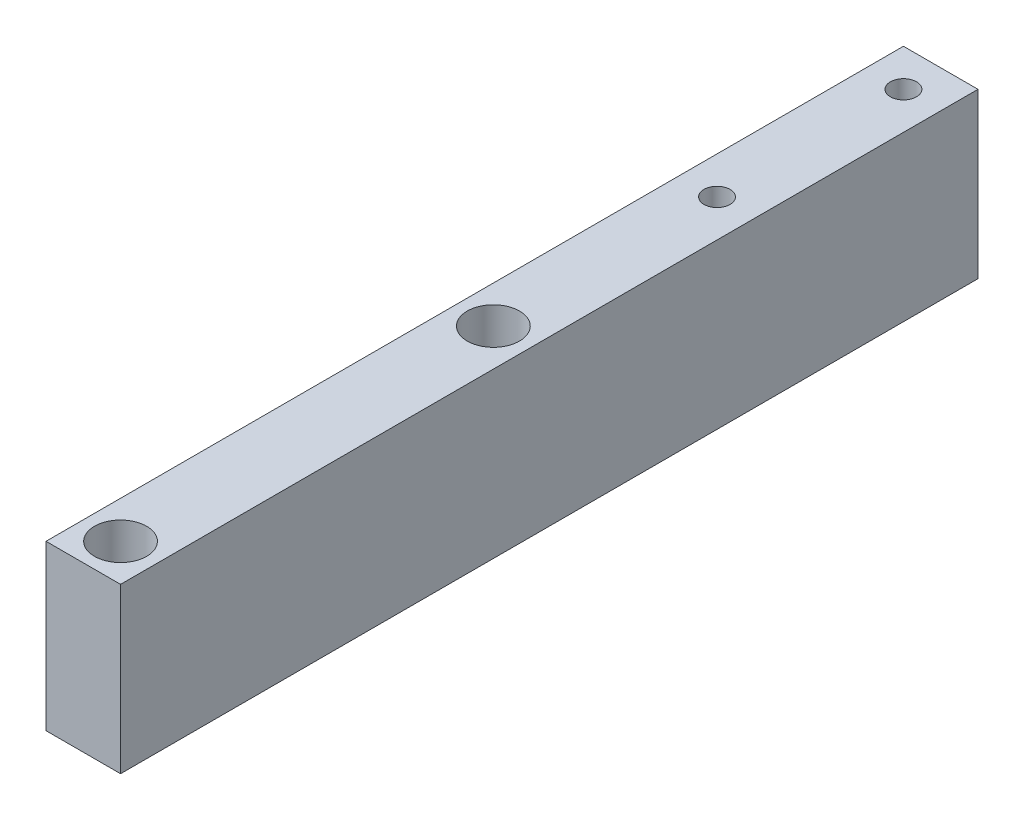
ISO-10303-21;
HEADER;
FILE_DESCRIPTION(('STEP AP214'),'2;1');
FILE_NAME('part.step','',(''),(''),'','','');
FILE_SCHEMA(('AUTOMOTIVE_DESIGN { 1 0 10303 214 1 1 1 1 }'));
ENDSEC;
DATA;
#1=APPLICATION_CONTEXT('core data for automotive mechanical design processes');
#2=APPLICATION_PROTOCOL_DEFINITION('international standard','automotive_design',2000,#1);
#3=PRODUCT_CONTEXT('',#1,'mechanical');
#4=PRODUCT('Part','Part','',(#3));
#5=PRODUCT_RELATED_PRODUCT_CATEGORY('part','',(#4));
#6=PRODUCT_DEFINITION_FORMATION('','',#4);
#7=PRODUCT_DEFINITION_CONTEXT('part definition',#1,'design');
#8=PRODUCT_DEFINITION('design','',#6,#7);
#9=PRODUCT_DEFINITION_SHAPE('','',#8);
#10=(LENGTH_UNIT() NAMED_UNIT(*) SI_UNIT(.MILLI.,.METRE.));
#11=(NAMED_UNIT(*) PLANE_ANGLE_UNIT() SI_UNIT($,.RADIAN.));
#12=(NAMED_UNIT(*) SI_UNIT($,.STERADIAN.) SOLID_ANGLE_UNIT());
#13=UNCERTAINTY_MEASURE_WITH_UNIT(LENGTH_MEASURE(1.E-05),#10,'distance_accuracy_value','');
#14=(GEOMETRIC_REPRESENTATION_CONTEXT(3) GLOBAL_UNCERTAINTY_ASSIGNED_CONTEXT((#13)) GLOBAL_UNIT_ASSIGNED_CONTEXT((#10,
#11,#12)) REPRESENTATION_CONTEXT('',''));
#15=CARTESIAN_POINT('',(0.,0.,0.));
#16=DIRECTION('',(0.,0.,1.));
#17=DIRECTION('',(1.,0.,0.));
#18=AXIS2_PLACEMENT_3D('',#15,#16,#17);
#19=CARTESIAN_POINT('',(0.,-5.79827560572969,2.50000000000001));
#20=DIRECTION('',(0.,1.,0.));
#21=DIRECTION('',(0.,0.,1.));
#22=AXIS2_PLACEMENT_3D('',#19,#20,#21);
#23=CYLINDRICAL_SURFACE('',#22,2.05);
#24=CARTESIAN_POINT('',(0.,0.,2.50000000000001));
#25=DIRECTION('',(0.,1.,0.));
#26=DIRECTION('',(0.,0.,1.));
#27=AXIS2_PLACEMENT_3D('',#24,#25,#26);
#28=CIRCLE('',#27,2.05);
#29=CARTESIAN_POINT('',(0.,0.,4.55000000000001));
#30=VERTEX_POINT('',#29);
#31=EDGE_CURVE('E116',#30,#30,#28,.F.);
#32=ORIENTED_EDGE('',*,*,#31,.T.);
#33=EDGE_LOOP('',(#32));
#34=FACE_BOUND('',#33,.T.);
#35=CARTESIAN_POINT('',(0.,10.,2.50000000000001));
#36=DIRECTION('',(0.,1.,0.));
#37=DIRECTION('',(0.,0.,1.));
#38=AXIS2_PLACEMENT_3D('',#35,#36,#37);
#39=CIRCLE('',#38,2.05);
#40=CARTESIAN_POINT('',(0.,10.,4.55000000000001));
#41=VERTEX_POINT('',#40);
#42=EDGE_CURVE('E39',#41,#41,#39,.F.);
#43=ORIENTED_EDGE('',*,*,#42,.F.);
#44=EDGE_LOOP('',(#43));
#45=FACE_BOUND('',#44,.T.);
#46=ADVANCED_FACE('F35',(#34,#45),#23,.F.);
#47=CARTESIAN_POINT('',(0.,-5.79827560572969,52.5));
#48=DIRECTION('',(0.,1.,0.));
#49=DIRECTION('',(0.,0.,1.));
#50=AXIS2_PLACEMENT_3D('',#47,#48,#49);
#51=CYLINDRICAL_SURFACE('',#50,2.05);
#52=CARTESIAN_POINT('',(0.,0.,52.5));
#53=DIRECTION('',(0.,1.,0.));
#54=DIRECTION('',(0.,0.,1.));
#55=AXIS2_PLACEMENT_3D('',#52,#53,#54);
#56=CIRCLE('',#55,2.05);
#57=CARTESIAN_POINT('',(0.,0.,54.55));
#58=VERTEX_POINT('',#57);
#59=EDGE_CURVE('E105',#58,#58,#56,.F.);
#60=ORIENTED_EDGE('',*,*,#59,.T.);
#61=EDGE_LOOP('',(#60));
#62=FACE_BOUND('',#61,.T.);
#63=CARTESIAN_POINT('',(0.,10.,52.5));
#64=DIRECTION('',(0.,1.,0.));
#65=DIRECTION('',(0.,0.,1.));
#66=AXIS2_PLACEMENT_3D('',#63,#64,#65);
#67=CIRCLE('',#66,2.05);
#68=CARTESIAN_POINT('',(0.,10.,54.55));
#69=VERTEX_POINT('',#68);
#70=EDGE_CURVE('E110',#69,#69,#67,.F.);
#71=ORIENTED_EDGE('',*,*,#70,.F.);
#72=EDGE_LOOP('',(#71));
#73=FACE_BOUND('',#72,.T.);
#74=ADVANCED_FACE('F159',(#62,#73),#51,.F.);
#75=CARTESIAN_POINT('',(4.99999999999999,22.,-57.5));
#76=DIRECTION('',(-1.,0.,0.));
#77=DIRECTION('',(0.,0.,1.));
#78=AXIS2_PLACEMENT_3D('',#75,#76,#77);
#79=PLANE('',#78);
#80=DIRECTION('',(0.,0.,-1.));
#81=VECTOR('',#80,1.);
#82=CARTESIAN_POINT('',(4.99999999999999,0.,-57.5));
#83=LINE('',#82,#81);
#84=CARTESIAN_POINT('',(5.00000000000001,0.,57.5));
#85=VERTEX_POINT('',#84);
#86=CARTESIAN_POINT('',(4.99999999999999,0.,-57.5));
#87=VERTEX_POINT('',#86);
#88=EDGE_CURVE('E102',#85,#87,#83,.T.);
#89=ORIENTED_EDGE('',*,*,#88,.T.);
#90=DIRECTION('',(0.,-1.,0.));
#91=VECTOR('',#90,1.);
#92=CARTESIAN_POINT('',(4.99999999999999,22.,-57.5));
#93=LINE('',#92,#91);
#94=CARTESIAN_POINT('',(4.99999999999999,22.,-57.5));
#95=VERTEX_POINT('',#94);
#96=EDGE_CURVE('E12',#95,#87,#93,.T.);
#97=ORIENTED_EDGE('',*,*,#96,.F.);
#98=DIRECTION('',(0.,0.,-1.));
#99=VECTOR('',#98,1.);
#100=CARTESIAN_POINT('',(4.99999999999999,22.,-57.5));
#101=LINE('',#100,#99);
#102=CARTESIAN_POINT('',(5.00000000000001,22.,57.5));
#103=VERTEX_POINT('',#102);
#104=EDGE_CURVE('E89',#103,#95,#101,.T.);
#105=ORIENTED_EDGE('',*,*,#104,.F.);
#106=DIRECTION('',(0.,-1.,0.));
#107=VECTOR('',#106,1.);
#108=CARTESIAN_POINT('',(5.00000000000001,22.,57.5));
#109=LINE('',#108,#107);
#110=EDGE_CURVE('E98',#103,#85,#109,.T.);
#111=ORIENTED_EDGE('',*,*,#110,.T.);
#112=EDGE_LOOP('',(#89,#97,#105,#111));
#113=FACE_BOUND('',#112,.T.);
#114=ADVANCED_FACE('F37',(#113),#79,.F.);
#115=CARTESIAN_POINT('',(-5.00000000000001,22.,-57.5));
#116=DIRECTION('',(0.,0.,1.));
#117=DIRECTION('',(1.,0.,0.));
#118=AXIS2_PLACEMENT_3D('',#115,#116,#117);
#119=PLANE('',#118);
#120=DIRECTION('',(-1.,0.,0.));
#121=VECTOR('',#120,1.);
#122=CARTESIAN_POINT('',(-5.00000000000001,0.,-57.5));
#123=LINE('',#122,#121);
#124=CARTESIAN_POINT('',(-5.00000000000001,0.,-57.5));
#125=VERTEX_POINT('',#124);
#126=EDGE_CURVE('E93',#87,#125,#123,.T.);
#127=ORIENTED_EDGE('',*,*,#126,.T.);
#128=DIRECTION('',(0.,-1.,0.));
#129=VECTOR('',#128,1.);
#130=CARTESIAN_POINT('',(-5.00000000000001,22.,-57.5));
#131=LINE('',#130,#129);
#132=CARTESIAN_POINT('',(-5.00000000000001,22.,-57.5));
#133=VERTEX_POINT('',#132);
#134=EDGE_CURVE('E45',#133,#125,#131,.T.);
#135=ORIENTED_EDGE('',*,*,#134,.F.);
#136=DIRECTION('',(-1.,0.,0.));
#137=VECTOR('',#136,1.);
#138=CARTESIAN_POINT('',(-5.00000000000001,22.,-57.5));
#139=LINE('',#138,#137);
#140=EDGE_CURVE('E84',#95,#133,#139,.T.);
#141=ORIENTED_EDGE('',*,*,#140,.F.);
#142=ORIENTED_EDGE('',*,*,#96,.T.);
#143=EDGE_LOOP('',(#127,#135,#141,#142));
#144=FACE_BOUND('',#143,.T.);
#145=ADVANCED_FACE('F92',(#144),#119,.F.);
#146=CARTESIAN_POINT('',(-5.00000000000001,22.,-57.5));
#147=DIRECTION('',(1.,0.,0.));
#148=DIRECTION('',(0.,0.,-1.));
#149=AXIS2_PLACEMENT_3D('',#146,#147,#148);
#150=PLANE('',#149);
#151=DIRECTION('',(0.,0.,1.));
#152=VECTOR('',#151,1.);
#153=CARTESIAN_POINT('',(-5.00000000000001,0.,-57.5));
#154=LINE('',#153,#152);
#155=CARTESIAN_POINT('',(-4.99999999999999,0.,57.5));
#156=VERTEX_POINT('',#155);
#157=EDGE_CURVE('E71',#125,#156,#154,.T.);
#158=ORIENTED_EDGE('',*,*,#157,.T.);
#159=DIRECTION('',(0.,-1.,0.));
#160=VECTOR('',#159,1.);
#161=CARTESIAN_POINT('',(-4.99999999999999,22.,57.5));
#162=LINE('',#161,#160);
#163=CARTESIAN_POINT('',(-4.99999999999999,22.,57.5));
#164=VERTEX_POINT('',#163);
#165=EDGE_CURVE('E94',#164,#156,#162,.T.);
#166=ORIENTED_EDGE('',*,*,#165,.F.);
#167=DIRECTION('',(0.,0.,1.));
#168=VECTOR('',#167,1.);
#169=CARTESIAN_POINT('',(-5.00000000000001,22.,-57.5));
#170=LINE('',#169,#168);
#171=EDGE_CURVE('E87',#133,#164,#170,.T.);
#172=ORIENTED_EDGE('',*,*,#171,.F.);
#173=ORIENTED_EDGE('',*,*,#134,.T.);
#174=EDGE_LOOP('',(#158,#166,#172,#173));
#175=FACE_BOUND('',#174,.T.);
#176=ADVANCED_FACE('F96',(#175),#150,.F.);
#177=CARTESIAN_POINT('',(-4.99999999999999,22.,57.5));
#178=DIRECTION('',(0.,0.,-1.));
#179=DIRECTION('',(-1.,0.,0.));
#180=AXIS2_PLACEMENT_3D('',#177,#178,#179);
#181=PLANE('',#180);
#182=DIRECTION('',(1.,0.,0.));
#183=VECTOR('',#182,1.);
#184=CARTESIAN_POINT('',(-4.99999999999999,0.,57.5));
#185=LINE('',#184,#183);
#186=EDGE_CURVE('E77',#156,#85,#185,.T.);
#187=ORIENTED_EDGE('',*,*,#186,.T.);
#188=ORIENTED_EDGE('',*,*,#110,.F.);
#189=DIRECTION('',(1.,0.,0.));
#190=VECTOR('',#189,1.);
#191=CARTESIAN_POINT('',(-4.99999999999999,22.,57.5));
#192=LINE('',#191,#190);
#193=EDGE_CURVE('E54',#164,#103,#192,.T.);
#194=ORIENTED_EDGE('',*,*,#193,.F.);
#195=ORIENTED_EDGE('',*,*,#165,.T.);
#196=EDGE_LOOP('',(#187,#188,#194,#195));
#197=FACE_BOUND('',#196,.T.);
#198=ADVANCED_FACE('F148',(#197),#181,.F.);
#199=CARTESIAN_POINT('',(0.,22.,0.));
#200=DIRECTION('',(0.,1.,0.));
#201=DIRECTION('',(0.,0.,1.));
#202=AXIS2_PLACEMENT_3D('',#199,#200,#201);
#203=PLANE('',#202);
#204=CARTESIAN_POINT('',(0.,22.,-52.5));
#205=DIRECTION('',(0.,1.,0.));
#206=DIRECTION('',(0.,0.,1.));
#207=AXIS2_PLACEMENT_3D('',#204,#205,#206);
#208=CIRCLE('',#207,1.75);
#209=CARTESIAN_POINT('',(0.,22.,-50.75));
#210=VERTEX_POINT('',#209);
#211=EDGE_CURVE('E195',#210,#210,#208,.T.);
#212=ORIENTED_EDGE('',*,*,#211,.F.);
#213=EDGE_LOOP('',(#212));
#214=FACE_BOUND('',#213,.T.);
#215=CARTESIAN_POINT('',(0.,22.,-27.5));
#216=DIRECTION('',(0.,1.,0.));
#217=DIRECTION('',(0.,0.,1.));
#218=AXIS2_PLACEMENT_3D('',#215,#216,#217);
#219=CIRCLE('',#218,1.75);
#220=CARTESIAN_POINT('',(0.,22.,-25.75));
#221=VERTEX_POINT('',#220);
#222=EDGE_CURVE('E200',#221,#221,#219,.T.);
#223=ORIENTED_EDGE('',*,*,#222,.F.);
#224=EDGE_LOOP('',(#223));
#225=FACE_BOUND('',#224,.T.);
#226=CARTESIAN_POINT('',(0.,22.,52.5));
#227=DIRECTION('',(0.,1.,0.));
#228=DIRECTION('',(0.,0.,1.));
#229=AXIS2_PLACEMENT_3D('',#226,#227,#228);
#230=CIRCLE('',#229,3.5);
#231=CARTESIAN_POINT('',(0.,22.,56.));
#232=VERTEX_POINT('',#231);
#233=EDGE_CURVE('E118',#232,#232,#230,.T.);
#234=ORIENTED_EDGE('',*,*,#233,.F.);
#235=EDGE_LOOP('',(#234));
#236=FACE_BOUND('',#235,.T.);
#237=CARTESIAN_POINT('',(0.,22.,2.50000000000001));
#238=DIRECTION('',(0.,1.,0.));
#239=DIRECTION('',(0.,0.,1.));
#240=AXIS2_PLACEMENT_3D('',#237,#238,#239);
#241=CIRCLE('',#240,3.5);
#242=CARTESIAN_POINT('',(0.,22.,6.00000000000001));
#243=VERTEX_POINT('',#242);
#244=EDGE_CURVE('E127',#243,#243,#241,.T.);
#245=ORIENTED_EDGE('',*,*,#244,.F.);
#246=EDGE_LOOP('',(#245));
#247=FACE_BOUND('',#246,.T.);
#248=ORIENTED_EDGE('',*,*,#104,.T.);
#249=ORIENTED_EDGE('',*,*,#140,.T.);
#250=ORIENTED_EDGE('',*,*,#171,.T.);
#251=ORIENTED_EDGE('',*,*,#193,.T.);
#252=EDGE_LOOP('',(#248,#249,#250,#251));
#253=FACE_BOUND('',#252,.T.);
#254=ADVANCED_FACE('F85',(#214,#225,#236,#247,#253),#203,.T.);
#255=CARTESIAN_POINT('',(0.,0.,0.));
#256=DIRECTION('',(0.,1.,0.));
#257=DIRECTION('',(0.,0.,1.));
#258=AXIS2_PLACEMENT_3D('',#255,#256,#257);
#259=PLANE('',#258);
#260=CARTESIAN_POINT('',(0.,0.,-52.5));
#261=DIRECTION('',(0.,1.,0.));
#262=DIRECTION('',(0.,0.,1.));
#263=AXIS2_PLACEMENT_3D('',#260,#261,#262);
#264=CIRCLE('',#263,1.75);
#265=CARTESIAN_POINT('',(0.,0.,-50.75));
#266=VERTEX_POINT('',#265);
#267=EDGE_CURVE('E130',#266,#266,#264,.T.);
#268=ORIENTED_EDGE('',*,*,#267,.T.);
#269=EDGE_LOOP('',(#268));
#270=FACE_BOUND('',#269,.T.);
#271=CARTESIAN_POINT('',(0.,0.,-27.5));
#272=DIRECTION('',(0.,1.,0.));
#273=DIRECTION('',(0.,0.,1.));
#274=AXIS2_PLACEMENT_3D('',#271,#272,#273);
#275=CIRCLE('',#274,1.75);
#276=CARTESIAN_POINT('',(0.,0.,-25.75));
#277=VERTEX_POINT('',#276);
#278=EDGE_CURVE('E196',#277,#277,#275,.T.);
#279=ORIENTED_EDGE('',*,*,#278,.T.);
#280=EDGE_LOOP('',(#279));
#281=FACE_BOUND('',#280,.T.);
#282=ORIENTED_EDGE('',*,*,#59,.F.);
#283=EDGE_LOOP('',(#282));
#284=FACE_BOUND('',#283,.T.);
#285=ORIENTED_EDGE('',*,*,#31,.F.);
#286=EDGE_LOOP('',(#285));
#287=FACE_BOUND('',#286,.T.);
#288=ORIENTED_EDGE('',*,*,#88,.F.);
#289=ORIENTED_EDGE('',*,*,#186,.F.);
#290=ORIENTED_EDGE('',*,*,#157,.F.);
#291=ORIENTED_EDGE('',*,*,#126,.F.);
#292=EDGE_LOOP('',(#288,#289,#290,#291));
#293=FACE_BOUND('',#292,.T.);
#294=ADVANCED_FACE('F140',(#270,#281,#284,#287,#293),#259,.F.);
#295=CARTESIAN_POINT('',(0.,10.,0.));
#296=DIRECTION('',(0.,1.,0.));
#297=DIRECTION('',(0.,0.,1.));
#298=AXIS2_PLACEMENT_3D('',#295,#296,#297);
#299=PLANE('',#298);
#300=CARTESIAN_POINT('',(0.,10.,52.5));
#301=DIRECTION('',(0.,1.,0.));
#302=DIRECTION('',(0.,0.,1.));
#303=AXIS2_PLACEMENT_3D('',#300,#301,#302);
#304=CIRCLE('',#303,3.5);
#305=CARTESIAN_POINT('',(0.,10.,56.));
#306=VERTEX_POINT('',#305);
#307=EDGE_CURVE('E112',#306,#306,#304,.F.);
#308=ORIENTED_EDGE('',*,*,#307,.F.);
#309=EDGE_LOOP('',(#308));
#310=FACE_BOUND('',#309,.T.);
#311=ORIENTED_EDGE('',*,*,#70,.T.);
#312=EDGE_LOOP('',(#311));
#313=FACE_BOUND('',#312,.T.);
#314=ADVANCED_FACE('F143',(#310,#313),#299,.T.);
#315=CARTESIAN_POINT('',(0.,-9.89949493661167,52.5));
#316=DIRECTION('',(0.,1.,0.));
#317=DIRECTION('',(0.,0.,1.));
#318=AXIS2_PLACEMENT_3D('',#315,#316,#317);
#319=CYLINDRICAL_SURFACE('',#318,3.5);
#320=ORIENTED_EDGE('',*,*,#307,.T.);
#321=EDGE_LOOP('',(#320));
#322=FACE_BOUND('',#321,.T.);
#323=ORIENTED_EDGE('',*,*,#233,.T.);
#324=EDGE_LOOP('',(#323));
#325=FACE_BOUND('',#324,.T.);
#326=ADVANCED_FACE('F175',(#322,#325),#319,.F.);
#327=CARTESIAN_POINT('',(0.,10.,0.));
#328=DIRECTION('',(0.,1.,0.));
#329=DIRECTION('',(0.,0.,1.));
#330=AXIS2_PLACEMENT_3D('',#327,#328,#329);
#331=PLANE('',#330);
#332=CARTESIAN_POINT('',(0.,10.,2.50000000000001));
#333=DIRECTION('',(0.,1.,0.));
#334=DIRECTION('',(0.,0.,1.));
#335=AXIS2_PLACEMENT_3D('',#332,#333,#334);
#336=CIRCLE('',#335,3.5);
#337=CARTESIAN_POINT('',(0.,10.,6.00000000000001));
#338=VERTEX_POINT('',#337);
#339=EDGE_CURVE('E123',#338,#338,#336,.F.);
#340=ORIENTED_EDGE('',*,*,#339,.F.);
#341=EDGE_LOOP('',(#340));
#342=FACE_BOUND('',#341,.T.);
#343=ORIENTED_EDGE('',*,*,#42,.T.);
#344=EDGE_LOOP('',(#343));
#345=FACE_BOUND('',#344,.T.);
#346=ADVANCED_FACE('F171',(#342,#345),#331,.T.);
#347=CARTESIAN_POINT('',(0.,-9.89949493661167,2.50000000000001));
#348=DIRECTION('',(0.,1.,0.));
#349=DIRECTION('',(0.,0.,1.));
#350=AXIS2_PLACEMENT_3D('',#347,#348,#349);
#351=CYLINDRICAL_SURFACE('',#350,3.5);
#352=ORIENTED_EDGE('',*,*,#339,.T.);
#353=EDGE_LOOP('',(#352));
#354=FACE_BOUND('',#353,.T.);
#355=ORIENTED_EDGE('',*,*,#244,.T.);
#356=EDGE_LOOP('',(#355));
#357=FACE_BOUND('',#356,.T.);
#358=ADVANCED_FACE('F167',(#354,#357),#351,.F.);
#359=CARTESIAN_POINT('',(0.,0.,-27.5));
#360=DIRECTION('',(0.,1.,0.));
#361=DIRECTION('',(0.,0.,1.));
#362=AXIS2_PLACEMENT_3D('',#359,#360,#361);
#363=CYLINDRICAL_SURFACE('',#362,1.75);
#364=ORIENTED_EDGE('',*,*,#278,.F.);
#365=EDGE_LOOP('',(#364));
#366=FACE_BOUND('',#365,.T.);
#367=ORIENTED_EDGE('',*,*,#222,.T.);
#368=EDGE_LOOP('',(#367));
#369=FACE_BOUND('',#368,.T.);
#370=ADVANCED_FACE('F170',(#366,#369),#363,.F.);
#371=CARTESIAN_POINT('',(0.,0.,-52.5));
#372=DIRECTION('',(0.,1.,0.));
#373=DIRECTION('',(0.,0.,1.));
#374=AXIS2_PLACEMENT_3D('',#371,#372,#373);
#375=CYLINDRICAL_SURFACE('',#374,1.75);
#376=ORIENTED_EDGE('',*,*,#267,.F.);
#377=EDGE_LOOP('',(#376));
#378=FACE_BOUND('',#377,.T.);
#379=ORIENTED_EDGE('',*,*,#211,.T.);
#380=EDGE_LOOP('',(#379));
#381=FACE_BOUND('',#380,.T.);
#382=ADVANCED_FACE('F184',(#378,#381),#375,.F.);
#383=CLOSED_SHELL('',(#46,#74,#114,#145,#176,#198,#254,#294,#314,#326,#346,#358,#370,#382));
#384=MANIFOLD_SOLID_BREP('B2',#383);
#385=ADVANCED_BREP_SHAPE_REPRESENTATION('',(#18,#384),#14);
#386=SHAPE_DEFINITION_REPRESENTATION(#9,#385);
ENDSEC;
END-ISO-10303-21;
